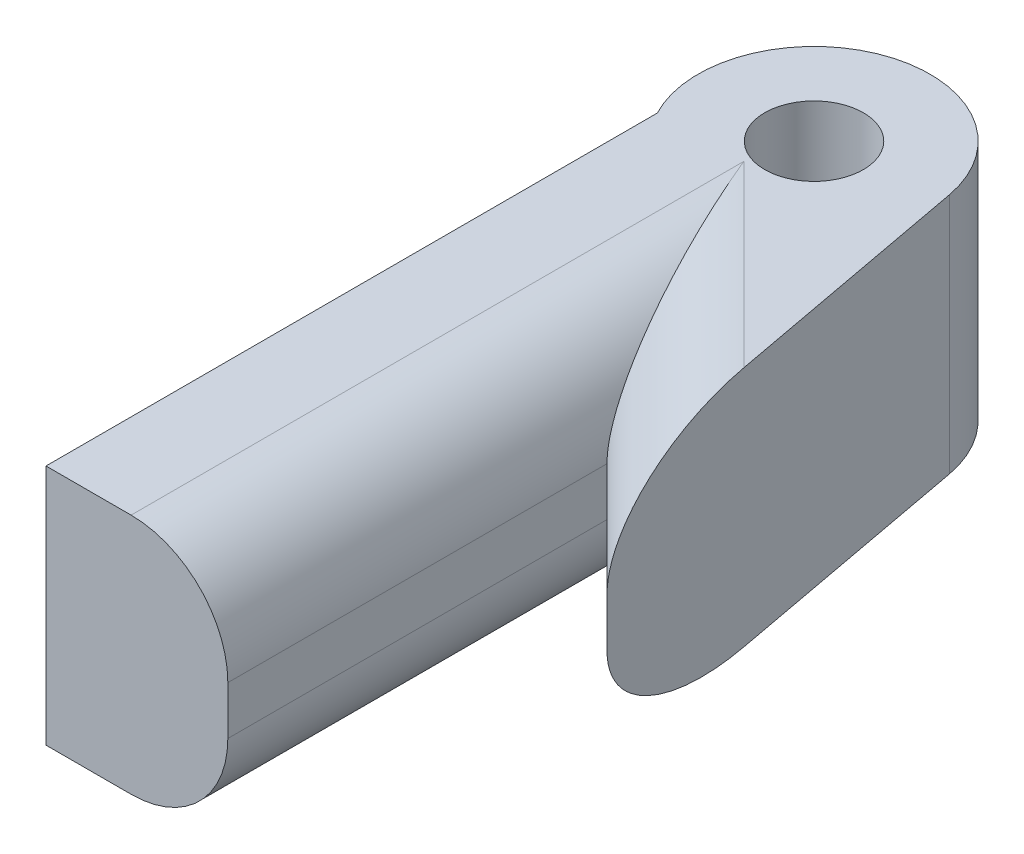
ISO-10303-21;
HEADER;
FILE_DESCRIPTION(('STEP AP214'),'2;1');
FILE_NAME('part.step','',(''),(''),'','','');
FILE_SCHEMA(('AUTOMOTIVE_DESIGN { 1 0 10303 214 1 1 1 1 }'));
ENDSEC;
DATA;
#1=APPLICATION_CONTEXT('core data for automotive mechanical design processes');
#2=APPLICATION_PROTOCOL_DEFINITION('international standard','automotive_design',2000,#1);
#3=PRODUCT_CONTEXT('',#1,'mechanical');
#4=PRODUCT('Part','Part','',(#3));
#5=PRODUCT_RELATED_PRODUCT_CATEGORY('part','',(#4));
#6=PRODUCT_DEFINITION_FORMATION('','',#4);
#7=PRODUCT_DEFINITION_CONTEXT('part definition',#1,'design');
#8=PRODUCT_DEFINITION('design','',#6,#7);
#9=PRODUCT_DEFINITION_SHAPE('','',#8);
#10=(LENGTH_UNIT() NAMED_UNIT(*) SI_UNIT(.MILLI.,.METRE.));
#11=(NAMED_UNIT(*) PLANE_ANGLE_UNIT() SI_UNIT($,.RADIAN.));
#12=(NAMED_UNIT(*) SI_UNIT($,.STERADIAN.) SOLID_ANGLE_UNIT());
#13=UNCERTAINTY_MEASURE_WITH_UNIT(LENGTH_MEASURE(1.E-05),#10,'distance_accuracy_value','');
#14=(GEOMETRIC_REPRESENTATION_CONTEXT(3) GLOBAL_UNCERTAINTY_ASSIGNED_CONTEXT((#13)) GLOBAL_UNIT_ASSIGNED_CONTEXT((#10,
#11,#12)) REPRESENTATION_CONTEXT('',''));
#15=CARTESIAN_POINT('',(0.,0.,0.));
#16=DIRECTION('',(0.,0.,1.));
#17=DIRECTION('',(1.,0.,0.));
#18=AXIS2_PLACEMENT_3D('',#15,#16,#17);
#19=CARTESIAN_POINT('',(-37.3932958683859,0.,-79.5683986357259));
#20=DIRECTION('',(-1.,0.,0.));
#21=DIRECTION('',(0.,0.,1.));
#22=AXIS2_PLACEMENT_3D('',#19,#20,#21);
#23=PLANE('',#22);
#24=DIRECTION('',(0.,0.,1.));
#25=VECTOR('',#24,1.);
#26=CARTESIAN_POINT('',(-37.3932958683859,12.7,-79.5683986357259));
#27=LINE('',#26,#25);
#28=CARTESIAN_POINT('',(-37.3932958683859,12.7,-119.700398635726));
#29=VERTEX_POINT('',#28);
#30=CARTESIAN_POINT('',(-37.3932958683859,12.7,-79.5683986357259));
#31=VERTEX_POINT('',#30);
#32=EDGE_CURVE('E163',#29,#31,#27,.T.);
#33=ORIENTED_EDGE('',*,*,#32,.F.);
#34=DIRECTION('',(0.,1.,0.));
#35=VECTOR('',#34,1.);
#36=CARTESIAN_POINT('',(-37.3932958683859,0.,-119.700398635726));
#37=LINE('',#36,#35);
#38=CARTESIAN_POINT('',(-37.3932958683859,-3.175,-119.700398635726));
#39=VERTEX_POINT('',#38);
#40=EDGE_CURVE('E141',#39,#29,#37,.T.);
#41=ORIENTED_EDGE('',*,*,#40,.F.);
#42=DIRECTION('',(0.,0.,1.));
#43=VECTOR('',#42,1.);
#44=CARTESIAN_POINT('',(-37.3932958683859,-3.175,-123.246347116511));
#45=LINE('',#44,#43);
#46=CARTESIAN_POINT('',(-37.3932958683859,-3.175,-79.5683986357259));
#47=VERTEX_POINT('',#46);
#48=EDGE_CURVE('E148',#39,#47,#45,.T.);
#49=ORIENTED_EDGE('',*,*,#48,.T.);
#50=DIRECTION('',(0.,1.,0.));
#51=VECTOR('',#50,1.);
#52=CARTESIAN_POINT('',(-37.3932958683859,0.,-79.5683986357259));
#53=LINE('',#52,#51);
#54=EDGE_CURVE('E178',#47,#31,#53,.T.);
#55=ORIENTED_EDGE('',*,*,#54,.T.);
#56=EDGE_LOOP('',(#33,#41,#49,#55));
#57=FACE_BOUND('',#56,.T.);
#58=ADVANCED_FACE('F45',(#57),#23,.T.);
#59=CARTESIAN_POINT('',(-30.6486202370739,0.,-123.246347116511));
#60=DIRECTION('',(0.,1.,0.));
#61=DIRECTION('',(0.,0.,1.));
#62=AXIS2_PLACEMENT_3D('',#59,#60,#61);
#63=CYLINDRICAL_SURFACE('',#62,7.62);
#64=CARTESIAN_POINT('',(-30.6486202370739,12.7,-123.246347116511));
#65=DIRECTION('',(0.,1.,0.));
#66=DIRECTION('',(0.,0.,1.));
#67=AXIS2_PLACEMENT_3D('',#64,#65,#66);
#68=CIRCLE('',#67,7.62);
#69=CARTESIAN_POINT('',(-23.1573113637474,12.7,-124.640869029003));
#70=VERTEX_POINT('',#69);
#71=EDGE_CURVE('E139',#70,#29,#68,.T.);
#72=ORIENTED_EDGE('',*,*,#71,.F.);
#73=DIRECTION('',(0.,1.,0.));
#74=VECTOR('',#73,1.);
#75=CARTESIAN_POINT('',(-23.1573113637474,0.,-124.640869029003));
#76=LINE('',#75,#74);
#77=CARTESIAN_POINT('',(-23.1573113637474,-3.175,-124.640869029003));
#78=VERTEX_POINT('',#77);
#79=EDGE_CURVE('E124',#78,#70,#76,.T.);
#80=ORIENTED_EDGE('',*,*,#79,.F.);
#81=CARTESIAN_POINT('',(-30.6486202370739,-3.175,-123.246347116511));
#82=DIRECTION('',(0.,1.,0.));
#83=DIRECTION('',(0.,0.,1.));
#84=AXIS2_PLACEMENT_3D('',#81,#82,#83);
#85=CIRCLE('',#84,7.62);
#86=EDGE_CURVE('E132',#78,#39,#85,.T.);
#87=ORIENTED_EDGE('',*,*,#86,.T.);
#88=ORIENTED_EDGE('',*,*,#40,.T.);
#89=EDGE_LOOP('',(#72,#80,#87,#88));
#90=FACE_BOUND('',#89,.T.);
#91=ADVANCED_FACE('F137',(#90),#63,.T.);
#92=CARTESIAN_POINT('',(-23.1573113637474,0.,-124.640869029003));
#93=DIRECTION('',(0.983111400699011,0.,-0.183008124998941));
#94=DIRECTION('',(-0.183008124998941,0.,-0.983111400699011));
#95=AXIS2_PLACEMENT_3D('',#92,#93,#94);
#96=PLANE('',#95);
#97=DIRECTION('',(0.,1.,0.));
#98=VECTOR('',#97,1.);
#99=CARTESIAN_POINT('',(-18.0158002505209,0.,-97.0209030178608));
#100=LINE('',#99,#98);
#101=CARTESIAN_POINT('',(-18.0158002505209,3.175,-97.0209030178608));
#102=VERTEX_POINT('',#101);
#103=CARTESIAN_POINT('',(-18.0158002505209,6.35,-97.0209030178608));
#104=VERTEX_POINT('',#103);
#105=EDGE_CURVE('E142',#102,#104,#100,.T.);
#106=ORIENTED_EDGE('',*,*,#105,.F.);
#107=CARTESIAN_POINT('',(-20.0698598758725,3.175,-108.055218764282));
#108=DIRECTION('',(0.983111400699011,0.,-0.183008124998941));
#109=DIRECTION('',(-0.183008124998941,0.,-0.983111400699011));
#110=AXIS2_PLACEMENT_3D('',#107,#108,#109);
#111=ELLIPSE('',#110,11.2238712098906,6.35);
#112=CARTESIAN_POINT('',(-20.0698598758725,-3.175,-108.055218764282));
#113=VERTEX_POINT('',#112);
#114=EDGE_CURVE('E127',#102,#113,#111,.T.);
#115=ORIENTED_EDGE('',*,*,#114,.T.);
#116=DIRECTION('',(-0.183008124998941,0.,-0.983111400699011));
#117=VECTOR('',#116,1.);
#118=CARTESIAN_POINT('',(-23.1573113637474,-3.175,-124.640869029003));
#119=LINE('',#118,#117);
#120=EDGE_CURVE('E119',#113,#78,#119,.T.);
#121=ORIENTED_EDGE('',*,*,#120,.T.);
#122=ORIENTED_EDGE('',*,*,#79,.T.);
#123=DIRECTION('',(-0.183008124998941,0.,-0.983111400699011));
#124=VECTOR('',#123,1.);
#125=CARTESIAN_POINT('',(-23.1573113637474,12.7,-124.640869029003));
#126=LINE('',#125,#124);
#127=CARTESIAN_POINT('',(-20.0698598758725,12.7,-108.055218764282));
#128=VERTEX_POINT('',#127);
#129=EDGE_CURVE('E173',#128,#70,#126,.T.);
#130=ORIENTED_EDGE('',*,*,#129,.F.);
#131=CARTESIAN_POINT('',(-20.0698598758725,6.35,-108.055218764282));
#132=DIRECTION('',(0.983111400699011,0.,-0.183008124998941));
#133=DIRECTION('',(0.183008124998941,0.,0.983111400699011));
#134=AXIS2_PLACEMENT_3D('',#131,#132,#133);
#135=ELLIPSE('',#134,11.2238712098906,6.35);
#136=EDGE_CURVE('E69',#128,#104,#135,.T.);
#137=ORIENTED_EDGE('',*,*,#136,.T.);
#138=EDGE_LOOP('',(#106,#115,#121,#122,#130,#137));
#139=FACE_BOUND('',#138,.T.);
#140=ADVANCED_FACE('F122',(#139),#96,.T.);
#141=CARTESIAN_POINT('',(-18.0158002505209,0.,-97.0209030178608));
#142=DIRECTION('',(-0.707106781186548,0.,0.707106781186547));
#143=DIRECTION('',(0.707106781186547,0.,0.707106781186548));
#144=AXIS2_PLACEMENT_3D('',#141,#142,#143);
#145=PLANE('',#144);
#146=DIRECTION('',(0.,1.,0.));
#147=VECTOR('',#146,1.);
#148=CARTESIAN_POINT('',(-25.4552958683859,0.,-104.460398635726));
#149=LINE('',#148,#147);
#150=CARTESIAN_POINT('',(-25.4552958683859,3.175,-104.460398635726));
#151=VERTEX_POINT('',#150);
#152=CARTESIAN_POINT('',(-25.4552958683859,6.35,-104.460398635726));
#153=VERTEX_POINT('',#152);
#154=EDGE_CURVE('E185',#151,#153,#149,.T.);
#155=ORIENTED_EDGE('',*,*,#154,.F.);
#156=DIRECTION('',(0.707106781186547,0.,0.707106781186548));
#157=VECTOR('',#156,1.);
#158=CARTESIAN_POINT('',(-18.0158002505209,3.175,-97.0209030178608));
#159=LINE('',#158,#157);
#160=EDGE_CURVE('E216',#151,#102,#159,.T.);
#161=ORIENTED_EDGE('',*,*,#160,.T.);
#162=ORIENTED_EDGE('',*,*,#105,.T.);
#163=DIRECTION('',(0.707106781186547,0.,0.707106781186548));
#164=VECTOR('',#163,1.);
#165=CARTESIAN_POINT('',(-18.0158002505209,6.35,-97.0209030178608));
#166=LINE('',#165,#164);
#167=EDGE_CURVE('E213',#104,#153,#166,.F.);
#168=ORIENTED_EDGE('',*,*,#167,.T.);
#169=EDGE_LOOP('',(#155,#161,#162,#168));
#170=FACE_BOUND('',#169,.T.);
#171=ADVANCED_FACE('F246',(#170),#145,.T.);
#172=CARTESIAN_POINT('',(-25.4552958683859,0.,-79.5683986357259));
#173=DIRECTION('',(1.,0.,0.));
#174=DIRECTION('',(0.,0.,-1.));
#175=AXIS2_PLACEMENT_3D('',#172,#173,#174);
#176=PLANE('',#175);
#177=DIRECTION('',(0.,1.,0.));
#178=VECTOR('',#177,1.);
#179=CARTESIAN_POINT('',(-25.4552958683859,0.,-79.5683986357259));
#180=LINE('',#179,#178);
#181=CARTESIAN_POINT('',(-25.4552958683859,3.175,-79.5683986357259));
#182=VERTEX_POINT('',#181);
#183=CARTESIAN_POINT('',(-25.4552958683859,6.35,-79.5683986357259));
#184=VERTEX_POINT('',#183);
#185=EDGE_CURVE('E189',#182,#184,#180,.T.);
#186=ORIENTED_EDGE('',*,*,#185,.F.);
#187=DIRECTION('',(0.,0.,-1.));
#188=VECTOR('',#187,1.);
#189=CARTESIAN_POINT('',(-25.4552958683859,3.175,-104.460398635726));
#190=LINE('',#189,#188);
#191=EDGE_CURVE('E197',#182,#151,#190,.T.);
#192=ORIENTED_EDGE('',*,*,#191,.T.);
#193=ORIENTED_EDGE('',*,*,#154,.T.);
#194=DIRECTION('',(0.,0.,-1.));
#195=VECTOR('',#194,1.);
#196=CARTESIAN_POINT('',(-25.4552958683859,6.35,-79.5683986357259));
#197=LINE('',#196,#195);
#198=EDGE_CURVE('E180',#153,#184,#197,.F.);
#199=ORIENTED_EDGE('',*,*,#198,.T.);
#200=EDGE_LOOP('',(#186,#192,#193,#199));
#201=FACE_BOUND('',#200,.T.);
#202=ADVANCED_FACE('F238',(#201),#176,.T.);
#203=CARTESIAN_POINT('',(-37.3932958683859,0.,-79.5683986357259));
#204=DIRECTION('',(0.,0.,1.));
#205=DIRECTION('',(1.,0.,0.));
#206=AXIS2_PLACEMENT_3D('',#203,#204,#205);
#207=PLANE('',#206);
#208=DIRECTION('',(1.,0.,0.));
#209=VECTOR('',#208,1.);
#210=CARTESIAN_POINT('',(-30.6486202370739,-3.175,-79.5683986357259));
#211=LINE('',#210,#209);
#212=CARTESIAN_POINT('',(-31.8052958683859,-3.175,-79.5683986357259));
#213=VERTEX_POINT('',#212);
#214=EDGE_CURVE('E152',#47,#213,#211,.T.);
#215=ORIENTED_EDGE('',*,*,#214,.T.);
#216=CARTESIAN_POINT('',(-31.8052958683859,3.175,-79.5683986357259));
#217=DIRECTION('',(0.,0.,1.));
#218=DIRECTION('',(1.,0.,0.));
#219=AXIS2_PLACEMENT_3D('',#216,#217,#218);
#220=CIRCLE('',#219,6.35);
#221=EDGE_CURVE('E210',#213,#182,#220,.T.);
#222=ORIENTED_EDGE('',*,*,#221,.T.);
#223=ORIENTED_EDGE('',*,*,#185,.T.);
#224=CARTESIAN_POINT('',(-31.8052958683859,6.35,-79.5683986357259));
#225=DIRECTION('',(0.,0.,1.));
#226=DIRECTION('',(1.,0.,0.));
#227=AXIS2_PLACEMENT_3D('',#224,#225,#226);
#228=CIRCLE('',#227,6.35);
#229=CARTESIAN_POINT('',(-31.8052958683859,12.7,-79.5683986357259));
#230=VERTEX_POINT('',#229);
#231=EDGE_CURVE('E207',#184,#230,#228,.T.);
#232=ORIENTED_EDGE('',*,*,#231,.T.);
#233=DIRECTION('',(1.,0.,0.));
#234=VECTOR('',#233,1.);
#235=CARTESIAN_POINT('',(-37.3932958683859,12.7,-79.5683986357259));
#236=LINE('',#235,#234);
#237=EDGE_CURVE('E170',#31,#230,#236,.T.);
#238=ORIENTED_EDGE('',*,*,#237,.F.);
#239=ORIENTED_EDGE('',*,*,#54,.F.);
#240=EDGE_LOOP('',(#215,#222,#223,#232,#238,#239));
#241=FACE_BOUND('',#240,.T.);
#242=ADVANCED_FACE('F241',(#241),#207,.T.);
#243=CARTESIAN_POINT('',(-30.6486202370739,12.7,-123.246347116511));
#244=DIRECTION('',(0.,1.,0.));
#245=DIRECTION('',(0.,0.,1.));
#246=AXIS2_PLACEMENT_3D('',#243,#244,#245);
#247=PLANE('',#246);
#248=CARTESIAN_POINT('',(-30.6486202370739,12.7,-123.246347116511));
#249=DIRECTION('',(0.,1.,0.));
#250=DIRECTION('',(0.,0.,1.));
#251=AXIS2_PLACEMENT_3D('',#248,#249,#250);
#252=CIRCLE('',#251,3.2385);
#253=CARTESIAN_POINT('',(-30.6486202370739,12.7,-120.007847116511));
#254=VERTEX_POINT('',#253);
#255=EDGE_CURVE('E158',#254,#254,#252,.T.);
#256=ORIENTED_EDGE('',*,*,#255,.F.);
#257=EDGE_LOOP('',(#256));
#258=FACE_BOUND('',#257,.T.);
#259=DIRECTION('',(0.,0.,-1.));
#260=VECTOR('',#259,1.);
#261=CARTESIAN_POINT('',(-31.8052958683859,12.7,-123.246347116511));
#262=LINE('',#261,#260);
#263=CARTESIAN_POINT('',(-31.8052958683859,12.7,-119.790654756795));
#264=VERTEX_POINT('',#263);
#265=EDGE_CURVE('E55',#230,#264,#262,.T.);
#266=ORIENTED_EDGE('',*,*,#265,.T.);
#267=DIRECTION('',(0.707106781186547,0.,0.707106781186548));
#268=VECTOR('',#267,1.);
#269=CARTESIAN_POINT('',(-32.9548042325881,12.7,-120.940163120997));
#270=LINE('',#269,#268);
#271=EDGE_CURVE('E11',#264,#128,#270,.T.);
#272=ORIENTED_EDGE('',*,*,#271,.T.);
#273=ORIENTED_EDGE('',*,*,#129,.T.);
#274=ORIENTED_EDGE('',*,*,#71,.T.);
#275=ORIENTED_EDGE('',*,*,#32,.T.);
#276=ORIENTED_EDGE('',*,*,#237,.T.);
#277=EDGE_LOOP('',(#266,#272,#273,#274,#275,#276));
#278=FACE_BOUND('',#277,.T.);
#279=ADVANCED_FACE('F251',(#258,#278),#247,.T.);
#280=CARTESIAN_POINT('',(-30.6486202370739,0.,-123.246347116511));
#281=DIRECTION('',(0.,1.,0.));
#282=DIRECTION('',(0.,0.,1.));
#283=AXIS2_PLACEMENT_3D('',#280,#281,#282);
#284=CYLINDRICAL_SURFACE('',#283,3.2385);
#285=CARTESIAN_POINT('',(-30.6486202370739,0.,-123.246347116511));
#286=DIRECTION('',(0.,1.,0.));
#287=DIRECTION('',(0.,0.,1.));
#288=AXIS2_PLACEMENT_3D('',#285,#286,#287);
#289=CIRCLE('',#288,3.2385);
#290=CARTESIAN_POINT('',(-30.6486202370739,0.,-120.007847116511));
#291=VERTEX_POINT('',#290);
#292=EDGE_CURVE('E159',#291,#291,#289,.T.);
#293=ORIENTED_EDGE('',*,*,#292,.F.);
#294=EDGE_LOOP('',(#293));
#295=FACE_BOUND('',#294,.T.);
#296=ORIENTED_EDGE('',*,*,#255,.T.);
#297=EDGE_LOOP('',(#296));
#298=FACE_BOUND('',#297,.T.);
#299=ADVANCED_FACE('F253',(#295,#298),#284,.F.);
#300=CARTESIAN_POINT('',(-30.6486202370739,0.,-123.246347116511));
#301=DIRECTION('',(0.,1.,0.));
#302=DIRECTION('',(0.,0.,1.));
#303=AXIS2_PLACEMENT_3D('',#300,#301,#302);
#304=PLANE('',#303);
#305=ORIENTED_EDGE('',*,*,#292,.T.);
#306=EDGE_LOOP('',(#305));
#307=FACE_BOUND('',#306,.T.);
#308=ADVANCED_FACE('F261',(#307),#304,.T.);
#309=CARTESIAN_POINT('',(-30.6486202370739,-3.175,-123.246347116511));
#310=DIRECTION('',(0.,1.,0.));
#311=DIRECTION('',(0.,0.,1.));
#312=AXIS2_PLACEMENT_3D('',#309,#310,#311);
#313=PLANE('',#312);
#314=DIRECTION('',(0.707106781186547,0.,0.707106781186548));
#315=VECTOR('',#314,1.);
#316=CARTESIAN_POINT('',(-20.9651678078514,-3.175,-108.95052669626));
#317=LINE('',#316,#315);
#318=CARTESIAN_POINT('',(-31.8052958683859,-3.175,-119.790654756795));
#319=VERTEX_POINT('',#318);
#320=EDGE_CURVE('E201',#113,#319,#317,.F.);
#321=ORIENTED_EDGE('',*,*,#320,.T.);
#322=DIRECTION('',(0.,0.,-1.));
#323=VECTOR('',#322,1.);
#324=CARTESIAN_POINT('',(-31.8052958683859,-3.175,-79.5683986357259));
#325=LINE('',#324,#323);
#326=EDGE_CURVE('E204',#319,#213,#325,.F.);
#327=ORIENTED_EDGE('',*,*,#326,.T.);
#328=ORIENTED_EDGE('',*,*,#214,.F.);
#329=ORIENTED_EDGE('',*,*,#48,.F.);
#330=ORIENTED_EDGE('',*,*,#86,.F.);
#331=ORIENTED_EDGE('',*,*,#120,.F.);
#332=EDGE_LOOP('',(#321,#327,#328,#329,#330,#331));
#333=FACE_BOUND('',#332,.T.);
#334=ADVANCED_FACE('F145',(#333),#313,.F.);
#335=CARTESIAN_POINT('',(-13.5256721899863,3.175,-101.511031078395));
#336=DIRECTION('',(-0.707106781186547,0.,-0.707106781186548));
#337=DIRECTION('',(-0.707106781186548,0.,0.707106781186547));
#338=AXIS2_PLACEMENT_3D('',#335,#336,#337);
#339=CYLINDRICAL_SURFACE('',#338,6.35);
#340=ORIENTED_EDGE('',*,*,#114,.F.);
#341=ORIENTED_EDGE('',*,*,#160,.F.);
#342=CARTESIAN_POINT('',(-31.8052958683859,3.175,-119.790654756795));
#343=DIRECTION('',(-0.923879532511287,0.,0.38268343236509));
#344=DIRECTION('',(0.38268343236509,0.,0.923879532511287));
#345=AXIS2_PLACEMENT_3D('',#342,#343,#344);
#346=ELLIPSE('',#345,16.59334965393,6.35);
#347=EDGE_CURVE('E133',#319,#151,#346,.T.);
#348=ORIENTED_EDGE('',*,*,#347,.F.);
#349=ORIENTED_EDGE('',*,*,#320,.F.);
#350=EDGE_LOOP('',(#340,#341,#348,#349));
#351=FACE_BOUND('',#350,.T.);
#352=ADVANCED_FACE('F248',(#351),#339,.T.);
#353=CARTESIAN_POINT('',(-31.8052958683859,3.175,-79.5683986357259));
#354=DIRECTION('',(0.,0.,1.));
#355=DIRECTION('',(1.,0.,0.));
#356=AXIS2_PLACEMENT_3D('',#353,#354,#355);
#357=CYLINDRICAL_SURFACE('',#356,6.35);
#358=ORIENTED_EDGE('',*,*,#221,.F.);
#359=ORIENTED_EDGE('',*,*,#326,.F.);
#360=ORIENTED_EDGE('',*,*,#347,.T.);
#361=ORIENTED_EDGE('',*,*,#191,.F.);
#362=EDGE_LOOP('',(#358,#359,#360,#361));
#363=FACE_BOUND('',#362,.T.);
#364=ADVANCED_FACE('F244',(#363),#357,.T.);
#365=CARTESIAN_POINT('',(-31.8052958683859,6.35,-123.246347116511));
#366=DIRECTION('',(0.,0.,-1.));
#367=DIRECTION('',(-1.,0.,0.));
#368=AXIS2_PLACEMENT_3D('',#365,#366,#367);
#369=CYLINDRICAL_SURFACE('',#368,6.35);
#370=ORIENTED_EDGE('',*,*,#231,.F.);
#371=ORIENTED_EDGE('',*,*,#198,.F.);
#372=CARTESIAN_POINT('',(-31.8052958683859,6.35,-119.790654756795));
#373=DIRECTION('',(0.923879532511287,0.,-0.38268343236509));
#374=DIRECTION('',(0.38268343236509,0.,0.923879532511287));
#375=AXIS2_PLACEMENT_3D('',#372,#373,#374);
#376=ELLIPSE('',#375,16.59334965393,6.35);
#377=EDGE_CURVE('E49',#264,#153,#376,.T.);
#378=ORIENTED_EDGE('',*,*,#377,.F.);
#379=ORIENTED_EDGE('',*,*,#265,.F.);
#380=EDGE_LOOP('',(#370,#371,#378,#379));
#381=FACE_BOUND('',#380,.T.);
#382=ADVANCED_FACE('F47',(#381),#369,.T.);
#383=CARTESIAN_POINT('',(-32.9548042325881,6.35,-120.940163120997));
#384=DIRECTION('',(0.707106781186547,0.,0.707106781186548));
#385=DIRECTION('',(0.707106781186548,0.,-0.707106781186547));
#386=AXIS2_PLACEMENT_3D('',#383,#384,#385);
#387=CYLINDRICAL_SURFACE('',#386,6.35);
#388=ORIENTED_EDGE('',*,*,#377,.T.);
#389=ORIENTED_EDGE('',*,*,#167,.F.);
#390=ORIENTED_EDGE('',*,*,#136,.F.);
#391=ORIENTED_EDGE('',*,*,#271,.F.);
#392=EDGE_LOOP('',(#388,#389,#390,#391));
#393=FACE_BOUND('',#392,.T.);
#394=ADVANCED_FACE('F232',(#393),#387,.T.);
#395=CLOSED_SHELL('',(#58,#91,#140,#171,#202,#242,#279,#299,#308,#334,#352,#364,#382,#394));
#396=MANIFOLD_SOLID_BREP('B2',#395);
#397=ADVANCED_BREP_SHAPE_REPRESENTATION('',(#18,#396),#14);
#398=SHAPE_DEFINITION_REPRESENTATION(#9,#397);
ENDSEC;
END-ISO-10303-21;
